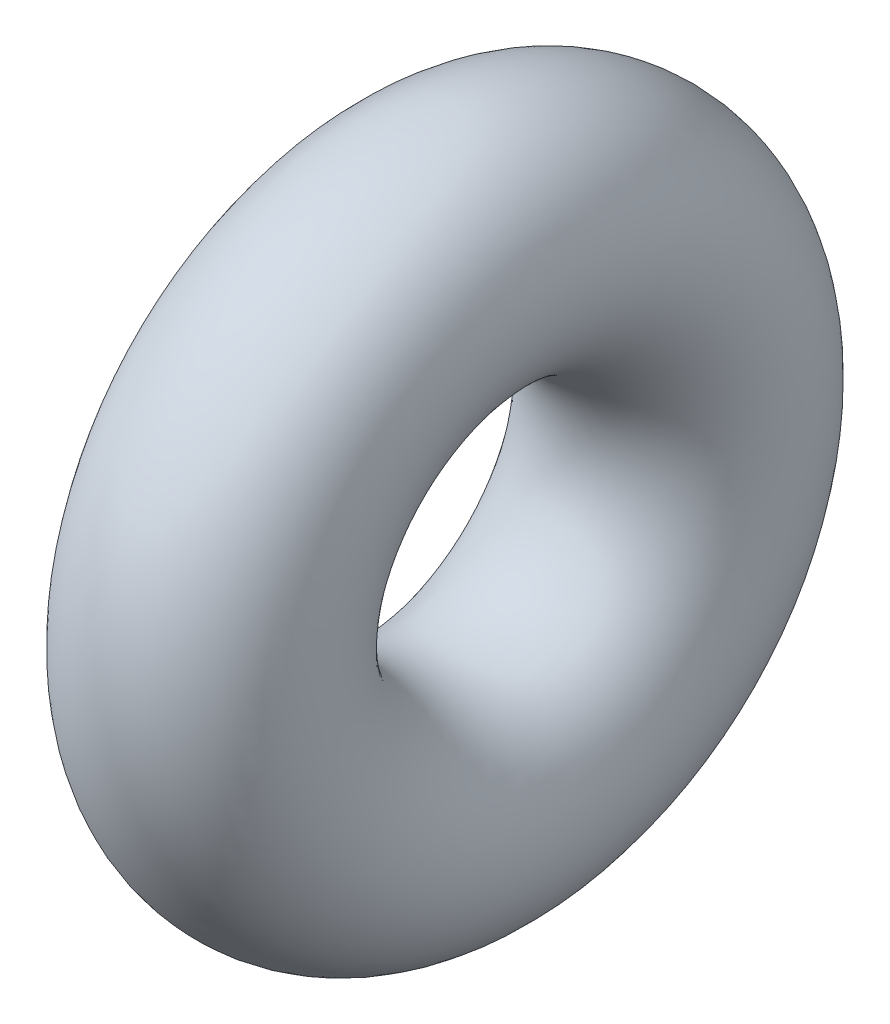
ISO-10303-21;
HEADER;
FILE_DESCRIPTION(('STEP AP214'),'2;1');
FILE_NAME('part.step','',(''),(''),'','','');
FILE_SCHEMA(('AUTOMOTIVE_DESIGN { 1 0 10303 214 1 1 1 1 }'));
ENDSEC;
DATA;
#1=APPLICATION_CONTEXT('core data for automotive mechanical design processes');
#2=APPLICATION_PROTOCOL_DEFINITION('international standard','automotive_design',2000,#1);
#3=PRODUCT_CONTEXT('',#1,'mechanical');
#4=PRODUCT('Part','Part','',(#3));
#5=PRODUCT_RELATED_PRODUCT_CATEGORY('part','',(#4));
#6=PRODUCT_DEFINITION_FORMATION('','',#4);
#7=PRODUCT_DEFINITION_CONTEXT('part definition',#1,'design');
#8=PRODUCT_DEFINITION('design','',#6,#7);
#9=PRODUCT_DEFINITION_SHAPE('','',#8);
#10=(LENGTH_UNIT() NAMED_UNIT(*) SI_UNIT(.MILLI.,.METRE.));
#11=(NAMED_UNIT(*) PLANE_ANGLE_UNIT() SI_UNIT($,.RADIAN.));
#12=(NAMED_UNIT(*) SI_UNIT($,.STERADIAN.) SOLID_ANGLE_UNIT());
#13=UNCERTAINTY_MEASURE_WITH_UNIT(LENGTH_MEASURE(1.E-05),#10,'distance_accuracy_value','');
#14=(GEOMETRIC_REPRESENTATION_CONTEXT(3) GLOBAL_UNCERTAINTY_ASSIGNED_CONTEXT((#13)) GLOBAL_UNIT_ASSIGNED_CONTEXT((#10,
#11,#12)) REPRESENTATION_CONTEXT('',''));
#15=CARTESIAN_POINT('',(0.,0.,0.));
#16=DIRECTION('',(0.,0.,1.));
#17=DIRECTION('',(1.,0.,0.));
#18=AXIS2_PLACEMENT_3D('',#15,#16,#17);
#19=CARTESIAN_POINT('',(3.6,-3.6,15.424059202831));
#20=DIRECTION('',(1.,0.,0.));
#21=DIRECTION('',(0.,0.,-1.));
#22=AXIS2_PLACEMENT_3D('',#19,#20,#21);
#23=TOROIDAL_SURFACE('',#22,0.333333333333,0.166666666667);
#24=ADVANCED_FACE('F14',(),#23,.T.);
#25=CLOSED_SHELL('',(#24));
#26=MANIFOLD_SOLID_BREP('B1',#25);
#27=ADVANCED_BREP_SHAPE_REPRESENTATION('',(#18,#26),#14);
#28=SHAPE_DEFINITION_REPRESENTATION(#9,#27);
ENDSEC;
END-ISO-10303-21;
